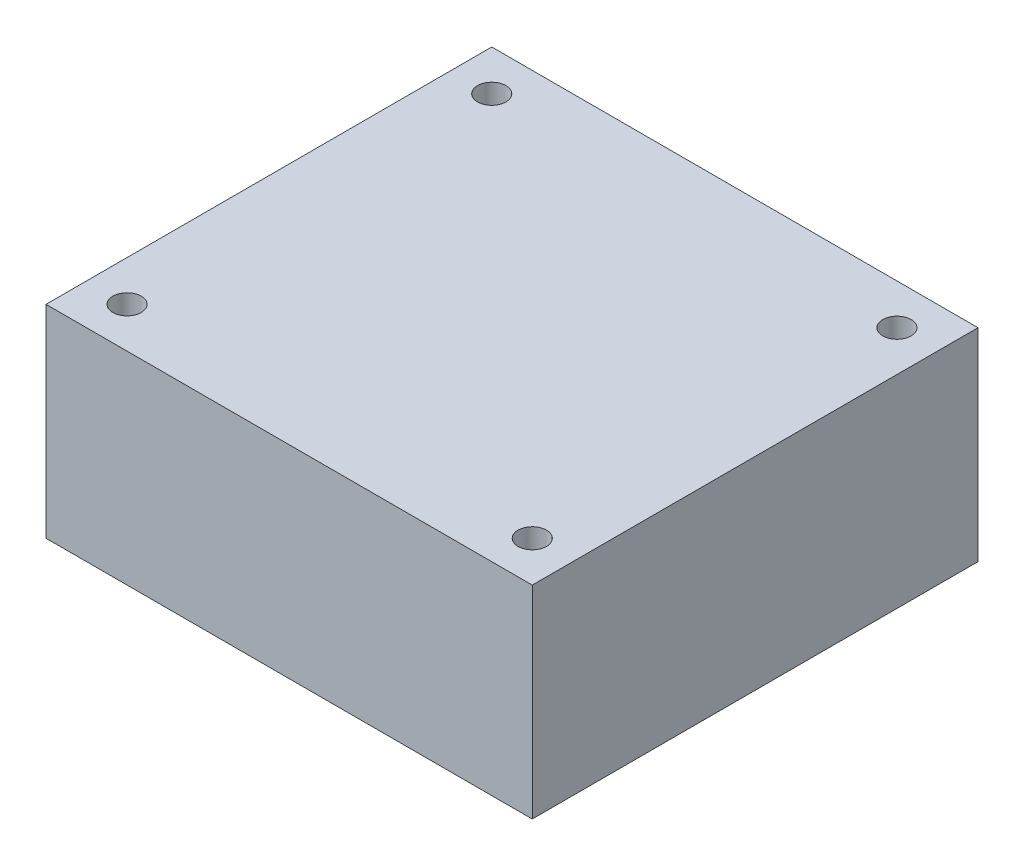
ISO-10303-21;
HEADER;
FILE_DESCRIPTION(('STEP AP214'),'2;1');
FILE_NAME('part.step','',(''),(''),'','','');
FILE_SCHEMA(('AUTOMOTIVE_DESIGN { 1 0 10303 214 1 1 1 1 }'));
ENDSEC;
DATA;
#1=APPLICATION_CONTEXT('core data for automotive mechanical design processes');
#2=APPLICATION_PROTOCOL_DEFINITION('international standard','automotive_design',2000,#1);
#3=PRODUCT_CONTEXT('',#1,'mechanical');
#4=PRODUCT('Part','Part','',(#3));
#5=PRODUCT_RELATED_PRODUCT_CATEGORY('part','',(#4));
#6=PRODUCT_DEFINITION_FORMATION('','',#4);
#7=PRODUCT_DEFINITION_CONTEXT('part definition',#1,'design');
#8=PRODUCT_DEFINITION('design','',#6,#7);
#9=PRODUCT_DEFINITION_SHAPE('','',#8);
#10=(LENGTH_UNIT() NAMED_UNIT(*) SI_UNIT(.MILLI.,.METRE.));
#11=(NAMED_UNIT(*) PLANE_ANGLE_UNIT() SI_UNIT($,.RADIAN.));
#12=(NAMED_UNIT(*) SI_UNIT($,.STERADIAN.) SOLID_ANGLE_UNIT());
#13=UNCERTAINTY_MEASURE_WITH_UNIT(LENGTH_MEASURE(1.E-05),#10,'distance_accuracy_value','');
#14=(GEOMETRIC_REPRESENTATION_CONTEXT(3) GLOBAL_UNCERTAINTY_ASSIGNED_CONTEXT((#13)) GLOBAL_UNIT_ASSIGNED_CONTEXT((#10,
#11,#12)) REPRESENTATION_CONTEXT('',''));
#15=CARTESIAN_POINT('',(0.,0.,0.));
#16=DIRECTION('',(0.,0.,1.));
#17=DIRECTION('',(1.,0.,0.));
#18=AXIS2_PLACEMENT_3D('',#15,#16,#17);
#19=CARTESIAN_POINT('',(22.,25.,38.7260273972603));
#20=DIRECTION('',(-1.,0.,0.));
#21=DIRECTION('',(0.,0.,1.));
#22=AXIS2_PLACEMENT_3D('',#19,#20,#21);
#23=PLANE('',#22);
#24=DIRECTION('',(0.,0.,-1.));
#25=VECTOR('',#24,1.);
#26=CARTESIAN_POINT('',(22.,0.,38.7260273972603));
#27=LINE('',#26,#25);
#28=CARTESIAN_POINT('',(22.,0.,38.7260273972603));
#29=VERTEX_POINT('',#28);
#30=CARTESIAN_POINT('',(22.,0.,-16.2739726027397));
#31=VERTEX_POINT('',#30);
#32=EDGE_CURVE('E100',#29,#31,#27,.T.);
#33=ORIENTED_EDGE('',*,*,#32,.T.);
#34=DIRECTION('',(0.,-1.,0.));
#35=VECTOR('',#34,1.);
#36=CARTESIAN_POINT('',(22.,25.,-16.2739726027397));
#37=LINE('',#36,#35);
#38=CARTESIAN_POINT('',(22.,25.,-16.2739726027397));
#39=VERTEX_POINT('',#38);
#40=EDGE_CURVE('E11',#39,#31,#37,.T.);
#41=ORIENTED_EDGE('',*,*,#40,.F.);
#42=DIRECTION('',(0.,0.,-1.));
#43=VECTOR('',#42,1.);
#44=CARTESIAN_POINT('',(22.,25.,38.7260273972603));
#45=LINE('',#44,#43);
#46=CARTESIAN_POINT('',(22.,25.,38.7260273972603));
#47=VERTEX_POINT('',#46);
#48=EDGE_CURVE('E88',#47,#39,#45,.T.);
#49=ORIENTED_EDGE('',*,*,#48,.F.);
#50=DIRECTION('',(0.,-1.,0.));
#51=VECTOR('',#50,1.);
#52=CARTESIAN_POINT('',(22.,25.,38.7260273972603));
#53=LINE('',#52,#51);
#54=EDGE_CURVE('E96',#47,#29,#53,.T.);
#55=ORIENTED_EDGE('',*,*,#54,.T.);
#56=EDGE_LOOP('',(#33,#41,#49,#55));
#57=FACE_BOUND('',#56,.T.);
#58=ADVANCED_FACE('F37',(#57),#23,.F.);
#59=CARTESIAN_POINT('',(-38.,25.,-16.2739726027397));
#60=DIRECTION('',(0.,0.,1.));
#61=DIRECTION('',(1.,0.,0.));
#62=AXIS2_PLACEMENT_3D('',#59,#60,#61);
#63=PLANE('',#62);
#64=DIRECTION('',(-1.,0.,0.));
#65=VECTOR('',#64,1.);
#66=CARTESIAN_POINT('',(-38.,0.,-16.2739726027397));
#67=LINE('',#66,#65);
#68=CARTESIAN_POINT('',(-38.,0.,-16.2739726027397));
#69=VERTEX_POINT('',#68);
#70=EDGE_CURVE('E92',#31,#69,#67,.T.);
#71=ORIENTED_EDGE('',*,*,#70,.T.);
#72=DIRECTION('',(0.,-1.,0.));
#73=VECTOR('',#72,1.);
#74=CARTESIAN_POINT('',(-38.,25.,-16.2739726027397));
#75=LINE('',#74,#73);
#76=CARTESIAN_POINT('',(-38.,25.,-16.2739726027397));
#77=VERTEX_POINT('',#76);
#78=EDGE_CURVE('E45',#77,#69,#75,.T.);
#79=ORIENTED_EDGE('',*,*,#78,.F.);
#80=DIRECTION('',(-1.,0.,0.));
#81=VECTOR('',#80,1.);
#82=CARTESIAN_POINT('',(-38.,25.,-16.2739726027397));
#83=LINE('',#82,#81);
#84=EDGE_CURVE('E83',#39,#77,#83,.T.);
#85=ORIENTED_EDGE('',*,*,#84,.F.);
#86=ORIENTED_EDGE('',*,*,#40,.T.);
#87=EDGE_LOOP('',(#71,#79,#85,#86));
#88=FACE_BOUND('',#87,.T.);
#89=ADVANCED_FACE('F91',(#88),#63,.F.);
#90=CARTESIAN_POINT('',(-38.,25.,38.7260273972603));
#91=DIRECTION('',(1.,0.,0.));
#92=DIRECTION('',(0.,0.,-1.));
#93=AXIS2_PLACEMENT_3D('',#90,#91,#92);
#94=PLANE('',#93);
#95=DIRECTION('',(0.,0.,1.));
#96=VECTOR('',#95,1.);
#97=CARTESIAN_POINT('',(-38.,0.,38.7260273972603));
#98=LINE('',#97,#96);
#99=CARTESIAN_POINT('',(-38.,0.,38.7260273972603));
#100=VERTEX_POINT('',#99);
#101=EDGE_CURVE('E70',#69,#100,#98,.T.);
#102=ORIENTED_EDGE('',*,*,#101,.T.);
#103=DIRECTION('',(0.,-1.,0.));
#104=VECTOR('',#103,1.);
#105=CARTESIAN_POINT('',(-38.,25.,38.7260273972603));
#106=LINE('',#105,#104);
#107=CARTESIAN_POINT('',(-38.,25.,38.7260273972603));
#108=VERTEX_POINT('',#107);
#109=EDGE_CURVE('E93',#108,#100,#106,.T.);
#110=ORIENTED_EDGE('',*,*,#109,.F.);
#111=DIRECTION('',(0.,0.,1.));
#112=VECTOR('',#111,1.);
#113=CARTESIAN_POINT('',(-38.,25.,38.7260273972603));
#114=LINE('',#113,#112);
#115=EDGE_CURVE('E86',#77,#108,#114,.T.);
#116=ORIENTED_EDGE('',*,*,#115,.F.);
#117=ORIENTED_EDGE('',*,*,#78,.T.);
#118=EDGE_LOOP('',(#102,#110,#116,#117));
#119=FACE_BOUND('',#118,.T.);
#120=ADVANCED_FACE('F94',(#119),#94,.F.);
#121=CARTESIAN_POINT('',(-38.,25.,38.7260273972603));
#122=DIRECTION('',(0.,0.,-1.));
#123=DIRECTION('',(-1.,0.,0.));
#124=AXIS2_PLACEMENT_3D('',#121,#122,#123);
#125=PLANE('',#124);
#126=DIRECTION('',(1.,0.,0.));
#127=VECTOR('',#126,1.);
#128=CARTESIAN_POINT('',(-38.,0.,38.7260273972603));
#129=LINE('',#128,#127);
#130=EDGE_CURVE('E76',#100,#29,#129,.T.);
#131=ORIENTED_EDGE('',*,*,#130,.T.);
#132=ORIENTED_EDGE('',*,*,#54,.F.);
#133=DIRECTION('',(1.,0.,0.));
#134=VECTOR('',#133,1.);
#135=CARTESIAN_POINT('',(-38.,25.,38.7260273972603));
#136=LINE('',#135,#134);
#137=EDGE_CURVE('E53',#108,#47,#136,.T.);
#138=ORIENTED_EDGE('',*,*,#137,.F.);
#139=ORIENTED_EDGE('',*,*,#109,.T.);
#140=EDGE_LOOP('',(#131,#132,#138,#139));
#141=FACE_BOUND('',#140,.T.);
#142=ADVANCED_FACE('F108',(#141),#125,.F.);
#143=CARTESIAN_POINT('',(0.,25.,0.));
#144=DIRECTION('',(0.,-1.,0.));
#145=DIRECTION('',(0.,0.,-1.));
#146=AXIS2_PLACEMENT_3D('',#143,#144,#145);
#147=PLANE('',#146);
#148=CARTESIAN_POINT('',(-33.,25.,33.7260273972603));
#149=DIRECTION('',(0.,1.,0.));
#150=DIRECTION('',(0.,0.,1.));
#151=AXIS2_PLACEMENT_3D('',#148,#149,#150);
#152=CIRCLE('',#151,1.75);
#153=CARTESIAN_POINT('',(-33.,25.,35.4760273972603));
#154=VERTEX_POINT('',#153);
#155=EDGE_CURVE('E123',#154,#154,#152,.T.);
#156=ORIENTED_EDGE('',*,*,#155,.F.);
#157=EDGE_LOOP('',(#156));
#158=FACE_BOUND('',#157,.T.);
#159=CARTESIAN_POINT('',(17.,25.,33.7260273972603));
#160=DIRECTION('',(0.,1.,0.));
#161=DIRECTION('',(0.,0.,1.));
#162=AXIS2_PLACEMENT_3D('',#159,#160,#161);
#163=CIRCLE('',#162,1.75);
#164=CARTESIAN_POINT('',(17.,25.,35.4760273972603));
#165=VERTEX_POINT('',#164);
#166=EDGE_CURVE('E129',#165,#165,#163,.T.);
#167=ORIENTED_EDGE('',*,*,#166,.F.);
#168=EDGE_LOOP('',(#167));
#169=FACE_BOUND('',#168,.T.);
#170=CARTESIAN_POINT('',(17.,25.,-11.2739726027397));
#171=DIRECTION('',(0.,1.,0.));
#172=DIRECTION('',(0.,0.,1.));
#173=AXIS2_PLACEMENT_3D('',#170,#171,#172);
#174=CIRCLE('',#173,1.75);
#175=CARTESIAN_POINT('',(17.,25.,-9.52397260273973));
#176=VERTEX_POINT('',#175);
#177=EDGE_CURVE('E117',#176,#176,#174,.T.);
#178=ORIENTED_EDGE('',*,*,#177,.F.);
#179=EDGE_LOOP('',(#178));
#180=FACE_BOUND('',#179,.T.);
#181=CARTESIAN_POINT('',(-33.,25.,-11.2739726027397));
#182=DIRECTION('',(0.,1.,0.));
#183=DIRECTION('',(0.,0.,1.));
#184=AXIS2_PLACEMENT_3D('',#181,#182,#183);
#185=CIRCLE('',#184,1.75);
#186=CARTESIAN_POINT('',(-33.,25.,-9.52397260273973));
#187=VERTEX_POINT('',#186);
#188=EDGE_CURVE('E114',#187,#187,#185,.T.);
#189=ORIENTED_EDGE('',*,*,#188,.F.);
#190=EDGE_LOOP('',(#189));
#191=FACE_BOUND('',#190,.T.);
#192=ORIENTED_EDGE('',*,*,#48,.T.);
#193=ORIENTED_EDGE('',*,*,#84,.T.);
#194=ORIENTED_EDGE('',*,*,#115,.T.);
#195=ORIENTED_EDGE('',*,*,#137,.T.);
#196=EDGE_LOOP('',(#192,#193,#194,#195));
#197=FACE_BOUND('',#196,.T.);
#198=ADVANCED_FACE('F84',(#158,#169,#180,#191,#197),#147,.F.);
#199=CARTESIAN_POINT('',(0.,0.,0.));
#200=DIRECTION('',(0.,-1.,0.));
#201=DIRECTION('',(0.,0.,-1.));
#202=AXIS2_PLACEMENT_3D('',#199,#200,#201);
#203=PLANE('',#202);
#204=CARTESIAN_POINT('',(-33.,0.,33.7260273972603));
#205=DIRECTION('',(0.,1.,0.));
#206=DIRECTION('',(0.,0.,1.));
#207=AXIS2_PLACEMENT_3D('',#204,#205,#206);
#208=CIRCLE('',#207,1.75);
#209=CARTESIAN_POINT('',(-33.,0.,35.4760273972603));
#210=VERTEX_POINT('',#209);
#211=EDGE_CURVE('E120',#210,#210,#208,.T.);
#212=ORIENTED_EDGE('',*,*,#211,.T.);
#213=EDGE_LOOP('',(#212));
#214=FACE_BOUND('',#213,.T.);
#215=CARTESIAN_POINT('',(17.,0.,33.7260273972603));
#216=DIRECTION('',(0.,1.,0.));
#217=DIRECTION('',(0.,0.,1.));
#218=AXIS2_PLACEMENT_3D('',#215,#216,#217);
#219=CIRCLE('',#218,1.75);
#220=CARTESIAN_POINT('',(17.,0.,35.4760273972603));
#221=VERTEX_POINT('',#220);
#222=EDGE_CURVE('E126',#221,#221,#219,.T.);
#223=ORIENTED_EDGE('',*,*,#222,.T.);
#224=EDGE_LOOP('',(#223));
#225=FACE_BOUND('',#224,.T.);
#226=CARTESIAN_POINT('',(17.,0.,-11.2739726027397));
#227=DIRECTION('',(0.,1.,0.));
#228=DIRECTION('',(0.,0.,1.));
#229=AXIS2_PLACEMENT_3D('',#226,#227,#228);
#230=CIRCLE('',#229,1.75);
#231=CARTESIAN_POINT('',(17.,0.,-9.52397260273973));
#232=VERTEX_POINT('',#231);
#233=EDGE_CURVE('E132',#232,#232,#230,.T.);
#234=ORIENTED_EDGE('',*,*,#233,.T.);
#235=EDGE_LOOP('',(#234));
#236=FACE_BOUND('',#235,.T.);
#237=CARTESIAN_POINT('',(-33.,0.,-11.2739726027397));
#238=DIRECTION('',(0.,1.,0.));
#239=DIRECTION('',(0.,0.,1.));
#240=AXIS2_PLACEMENT_3D('',#237,#238,#239);
#241=CIRCLE('',#240,1.75);
#242=CARTESIAN_POINT('',(-33.,0.,-9.52397260273973));
#243=VERTEX_POINT('',#242);
#244=EDGE_CURVE('E103',#243,#243,#241,.T.);
#245=ORIENTED_EDGE('',*,*,#244,.T.);
#246=EDGE_LOOP('',(#245));
#247=FACE_BOUND('',#246,.T.);
#248=ORIENTED_EDGE('',*,*,#32,.F.);
#249=ORIENTED_EDGE('',*,*,#130,.F.);
#250=ORIENTED_EDGE('',*,*,#101,.F.);
#251=ORIENTED_EDGE('',*,*,#70,.F.);
#252=EDGE_LOOP('',(#248,#249,#250,#251));
#253=FACE_BOUND('',#252,.T.);
#254=ADVANCED_FACE('F111',(#214,#225,#236,#247,#253),#203,.T.);
#255=CARTESIAN_POINT('',(-33.,0.,-11.2739726027397));
#256=DIRECTION('',(0.,1.,0.));
#257=DIRECTION('',(0.,0.,1.));
#258=AXIS2_PLACEMENT_3D('',#255,#256,#257);
#259=CYLINDRICAL_SURFACE('',#258,1.75);
#260=ORIENTED_EDGE('',*,*,#244,.F.);
#261=EDGE_LOOP('',(#260));
#262=FACE_BOUND('',#261,.T.);
#263=ORIENTED_EDGE('',*,*,#188,.T.);
#264=EDGE_LOOP('',(#263));
#265=FACE_BOUND('',#264,.T.);
#266=ADVANCED_FACE('F146',(#262,#265),#259,.F.);
#267=CARTESIAN_POINT('',(17.,0.,-11.2739726027397));
#268=DIRECTION('',(0.,1.,0.));
#269=DIRECTION('',(0.,0.,1.));
#270=AXIS2_PLACEMENT_3D('',#267,#268,#269);
#271=CYLINDRICAL_SURFACE('',#270,1.75);
#272=ORIENTED_EDGE('',*,*,#233,.F.);
#273=EDGE_LOOP('',(#272));
#274=FACE_BOUND('',#273,.T.);
#275=ORIENTED_EDGE('',*,*,#177,.T.);
#276=EDGE_LOOP('',(#275));
#277=FACE_BOUND('',#276,.T.);
#278=ADVANCED_FACE('F138',(#274,#277),#271,.F.);
#279=CARTESIAN_POINT('',(17.,0.,33.7260273972603));
#280=DIRECTION('',(0.,1.,0.));
#281=DIRECTION('',(0.,0.,1.));
#282=AXIS2_PLACEMENT_3D('',#279,#280,#281);
#283=CYLINDRICAL_SURFACE('',#282,1.75);
#284=ORIENTED_EDGE('',*,*,#222,.F.);
#285=EDGE_LOOP('',(#284));
#286=FACE_BOUND('',#285,.T.);
#287=ORIENTED_EDGE('',*,*,#166,.T.);
#288=EDGE_LOOP('',(#287));
#289=FACE_BOUND('',#288,.T.);
#290=ADVANCED_FACE('F154',(#286,#289),#283,.F.);
#291=CARTESIAN_POINT('',(-33.,0.,33.7260273972603));
#292=DIRECTION('',(0.,1.,0.));
#293=DIRECTION('',(0.,0.,1.));
#294=AXIS2_PLACEMENT_3D('',#291,#292,#293);
#295=CYLINDRICAL_SURFACE('',#294,1.75);
#296=ORIENTED_EDGE('',*,*,#211,.F.);
#297=EDGE_LOOP('',(#296));
#298=FACE_BOUND('',#297,.T.);
#299=ORIENTED_EDGE('',*,*,#155,.T.);
#300=EDGE_LOOP('',(#299));
#301=FACE_BOUND('',#300,.T.);
#302=ADVANCED_FACE('F205',(#298,#301),#295,.F.);
#303=CLOSED_SHELL('',(#58,#89,#120,#142,#198,#254,#266,#278,#290,#302));
#304=MANIFOLD_SOLID_BREP('B2',#303);
#305=ADVANCED_BREP_SHAPE_REPRESENTATION('',(#18,#304),#14);
#306=SHAPE_DEFINITION_REPRESENTATION(#9,#305);
ENDSEC;
END-ISO-10303-21;
